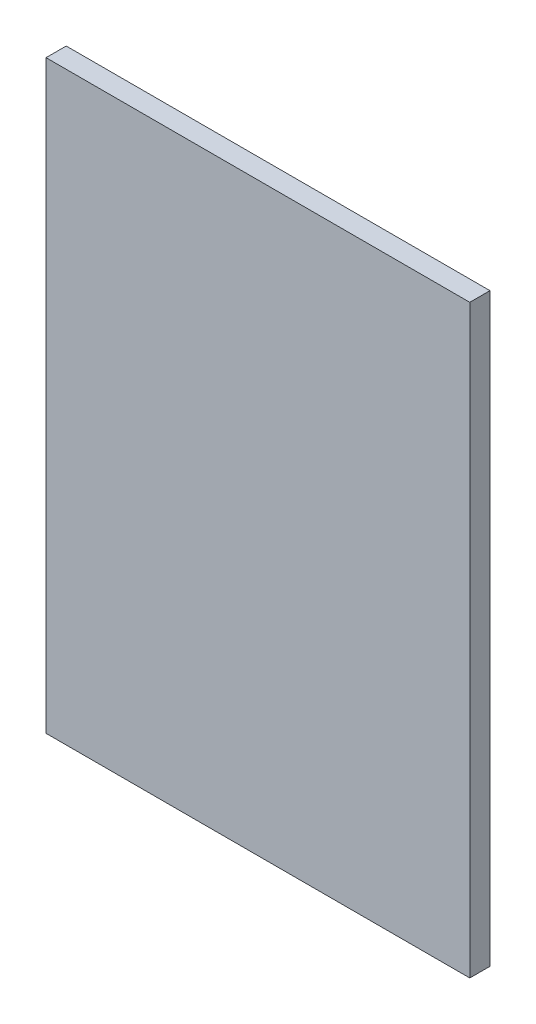
ISO-10303-21;
HEADER;
FILE_DESCRIPTION(('STEP AP214'),'2;1');
FILE_NAME('part.step','',(''),(''),'','','');
FILE_SCHEMA(('AUTOMOTIVE_DESIGN { 1 0 10303 214 1 1 1 1 }'));
ENDSEC;
DATA;
#1=APPLICATION_CONTEXT('core data for automotive mechanical design processes');
#2=APPLICATION_PROTOCOL_DEFINITION('international standard','automotive_design',2000,#1);
#3=PRODUCT_CONTEXT('',#1,'mechanical');
#4=PRODUCT('Part','Part','',(#3));
#5=PRODUCT_RELATED_PRODUCT_CATEGORY('part','',(#4));
#6=PRODUCT_DEFINITION_FORMATION('','',#4);
#7=PRODUCT_DEFINITION_CONTEXT('part definition',#1,'design');
#8=PRODUCT_DEFINITION('design','',#6,#7);
#9=PRODUCT_DEFINITION_SHAPE('','',#8);
#10=(LENGTH_UNIT() NAMED_UNIT(*) SI_UNIT(.MILLI.,.METRE.));
#11=(NAMED_UNIT(*) PLANE_ANGLE_UNIT() SI_UNIT($,.RADIAN.));
#12=(NAMED_UNIT(*) SI_UNIT($,.STERADIAN.) SOLID_ANGLE_UNIT());
#13=UNCERTAINTY_MEASURE_WITH_UNIT(LENGTH_MEASURE(1.E-05),#10,'distance_accuracy_value','');
#14=(GEOMETRIC_REPRESENTATION_CONTEXT(3) GLOBAL_UNCERTAINTY_ASSIGNED_CONTEXT((#13)) GLOBAL_UNIT_ASSIGNED_CONTEXT((#10,
#11,#12)) REPRESENTATION_CONTEXT('',''));
#15=CARTESIAN_POINT('',(0.,0.,0.));
#16=DIRECTION('',(0.,0.,1.));
#17=DIRECTION('',(1.,0.,0.));
#18=AXIS2_PLACEMENT_3D('',#15,#16,#17);
#19=CARTESIAN_POINT('',(-23.4490358126722,14.6776859504132,-2.));
#20=DIRECTION('',(-1.,0.,0.));
#21=DIRECTION('',(0.,0.,1.));
#22=AXIS2_PLACEMENT_3D('',#19,#20,#21);
#23=PLANE('',#22);
#24=DIRECTION('',(0.,-1.,0.));
#25=VECTOR('',#24,1.);
#26=CARTESIAN_POINT('',(-23.4490358126722,14.6776859504132,0.));
#27=LINE('',#26,#25);
#28=CARTESIAN_POINT('',(-23.4490358126722,14.6776859504132,0.));
#29=VERTEX_POINT('',#28);
#30=CARTESIAN_POINT('',(-23.4490358126722,-43.3223140495868,0.));
#31=VERTEX_POINT('',#30);
#32=EDGE_CURVE('E97',#29,#31,#27,.T.);
#33=ORIENTED_EDGE('',*,*,#32,.F.);
#34=DIRECTION('',(0.,0.,1.));
#35=VECTOR('',#34,1.);
#36=CARTESIAN_POINT('',(-23.4490358126722,14.6776859504132,-2.));
#37=LINE('',#36,#35);
#38=CARTESIAN_POINT('',(-23.4490358126722,14.6776859504132,-2.));
#39=VERTEX_POINT('',#38);
#40=EDGE_CURVE('E11',#39,#29,#37,.T.);
#41=ORIENTED_EDGE('',*,*,#40,.F.);
#42=DIRECTION('',(0.,-1.,0.));
#43=VECTOR('',#42,1.);
#44=CARTESIAN_POINT('',(-23.4490358126722,14.6776859504132,-2.));
#45=LINE('',#44,#43);
#46=CARTESIAN_POINT('',(-23.4490358126722,-43.3223140495868,-2.));
#47=VERTEX_POINT('',#46);
#48=EDGE_CURVE('E91',#39,#47,#45,.T.);
#49=ORIENTED_EDGE('',*,*,#48,.T.);
#50=DIRECTION('',(0.,0.,1.));
#51=VECTOR('',#50,1.);
#52=CARTESIAN_POINT('',(-23.4490358126722,-43.3223140495868,-2.));
#53=LINE('',#52,#51);
#54=EDGE_CURVE('E36',#47,#31,#53,.T.);
#55=ORIENTED_EDGE('',*,*,#54,.T.);
#56=EDGE_LOOP('',(#33,#41,#49,#55));
#57=FACE_BOUND('',#56,.T.);
#58=ADVANCED_FACE('F33',(#57),#23,.T.);
#59=CARTESIAN_POINT('',(-23.4490358126722,14.6776859504132,-2.));
#60=DIRECTION('',(0.,1.,0.));
#61=DIRECTION('',(0.,0.,1.));
#62=AXIS2_PLACEMENT_3D('',#59,#60,#61);
#63=PLANE('',#62);
#64=DIRECTION('',(-1.,0.,0.));
#65=VECTOR('',#64,1.);
#66=CARTESIAN_POINT('',(-23.4490358126722,14.6776859504132,0.));
#67=LINE('',#66,#65);
#68=CARTESIAN_POINT('',(18.5509641873278,14.6776859504132,0.));
#69=VERTEX_POINT('',#68);
#70=EDGE_CURVE('E93',#69,#29,#67,.T.);
#71=ORIENTED_EDGE('',*,*,#70,.F.);
#72=DIRECTION('',(0.,0.,1.));
#73=VECTOR('',#72,1.);
#74=CARTESIAN_POINT('',(18.5509641873278,14.6776859504132,-2.));
#75=LINE('',#74,#73);
#76=CARTESIAN_POINT('',(18.5509641873278,14.6776859504132,-2.));
#77=VERTEX_POINT('',#76);
#78=EDGE_CURVE('E42',#77,#69,#75,.T.);
#79=ORIENTED_EDGE('',*,*,#78,.F.);
#80=DIRECTION('',(-1.,0.,0.));
#81=VECTOR('',#80,1.);
#82=CARTESIAN_POINT('',(-23.4490358126722,14.6776859504132,-2.));
#83=LINE('',#82,#81);
#84=EDGE_CURVE('E88',#77,#39,#83,.T.);
#85=ORIENTED_EDGE('',*,*,#84,.T.);
#86=ORIENTED_EDGE('',*,*,#40,.T.);
#87=EDGE_LOOP('',(#71,#79,#85,#86));
#88=FACE_BOUND('',#87,.T.);
#89=ADVANCED_FACE('F107',(#88),#63,.T.);
#90=CARTESIAN_POINT('',(18.5509641873278,14.6776859504132,-2.));
#91=DIRECTION('',(1.,0.,0.));
#92=DIRECTION('',(0.,1.,0.));
#93=AXIS2_PLACEMENT_3D('',#90,#91,#92);
#94=PLANE('',#93);
#95=DIRECTION('',(0.,1.,0.));
#96=VECTOR('',#95,1.);
#97=CARTESIAN_POINT('',(18.5509641873278,14.6776859504132,0.));
#98=LINE('',#97,#96);
#99=CARTESIAN_POINT('',(18.5509641873278,-43.3223140495868,0.));
#100=VERTEX_POINT('',#99);
#101=EDGE_CURVE('E83',#100,#69,#98,.T.);
#102=ORIENTED_EDGE('',*,*,#101,.F.);
#103=DIRECTION('',(0.,0.,1.));
#104=VECTOR('',#103,1.);
#105=CARTESIAN_POINT('',(18.5509641873278,-43.3223140495868,-2.));
#106=LINE('',#105,#104);
#107=CARTESIAN_POINT('',(18.5509641873278,-43.3223140495868,-2.));
#108=VERTEX_POINT('',#107);
#109=EDGE_CURVE('E78',#108,#100,#106,.T.);
#110=ORIENTED_EDGE('',*,*,#109,.F.);
#111=DIRECTION('',(0.,1.,0.));
#112=VECTOR('',#111,1.);
#113=CARTESIAN_POINT('',(18.5509641873278,14.6776859504132,-2.));
#114=LINE('',#113,#112);
#115=EDGE_CURVE('E81',#108,#77,#114,.T.);
#116=ORIENTED_EDGE('',*,*,#115,.T.);
#117=ORIENTED_EDGE('',*,*,#78,.T.);
#118=EDGE_LOOP('',(#102,#110,#116,#117));
#119=FACE_BOUND('',#118,.T.);
#120=ADVANCED_FACE('F80',(#119),#94,.T.);
#121=CARTESIAN_POINT('',(-23.4490358126722,-43.3223140495868,-2.));
#122=DIRECTION('',(0.,-1.,0.));
#123=DIRECTION('',(0.,0.,-1.));
#124=AXIS2_PLACEMENT_3D('',#121,#122,#123);
#125=PLANE('',#124);
#126=DIRECTION('',(1.,0.,0.));
#127=VECTOR('',#126,1.);
#128=CARTESIAN_POINT('',(-23.4490358126722,-43.3223140495868,0.));
#129=LINE('',#128,#127);
#130=EDGE_CURVE('E100',#31,#100,#129,.T.);
#131=ORIENTED_EDGE('',*,*,#130,.F.);
#132=ORIENTED_EDGE('',*,*,#54,.F.);
#133=DIRECTION('',(1.,0.,0.));
#134=VECTOR('',#133,1.);
#135=CARTESIAN_POINT('',(-23.4490358126722,-43.3223140495868,-2.));
#136=LINE('',#135,#134);
#137=EDGE_CURVE('E87',#47,#108,#136,.T.);
#138=ORIENTED_EDGE('',*,*,#137,.T.);
#139=ORIENTED_EDGE('',*,*,#109,.T.);
#140=EDGE_LOOP('',(#131,#132,#138,#139));
#141=FACE_BOUND('',#140,.T.);
#142=ADVANCED_FACE('F90',(#141),#125,.T.);
#143=CARTESIAN_POINT('',(0.,0.,-2.));
#144=DIRECTION('',(0.,0.,1.));
#145=DIRECTION('',(1.,0.,0.));
#146=AXIS2_PLACEMENT_3D('',#143,#144,#145);
#147=PLANE('',#146);
#148=ORIENTED_EDGE('',*,*,#48,.F.);
#149=ORIENTED_EDGE('',*,*,#84,.F.);
#150=ORIENTED_EDGE('',*,*,#115,.F.);
#151=ORIENTED_EDGE('',*,*,#137,.F.);
#152=EDGE_LOOP('',(#148,#149,#150,#151));
#153=FACE_BOUND('',#152,.T.);
#154=ADVANCED_FACE('F86',(#153),#147,.F.);
#155=CARTESIAN_POINT('',(0.,0.,0.));
#156=DIRECTION('',(0.,0.,1.));
#157=DIRECTION('',(1.,0.,0.));
#158=AXIS2_PLACEMENT_3D('',#155,#156,#157);
#159=PLANE('',#158);
#160=ORIENTED_EDGE('',*,*,#32,.T.);
#161=ORIENTED_EDGE('',*,*,#130,.T.);
#162=ORIENTED_EDGE('',*,*,#101,.T.);
#163=ORIENTED_EDGE('',*,*,#70,.T.);
#164=EDGE_LOOP('',(#160,#161,#162,#163));
#165=FACE_BOUND('',#164,.T.);
#166=ADVANCED_FACE('F106',(#165),#159,.T.);
#167=CLOSED_SHELL('',(#58,#89,#120,#142,#154,#166));
#168=MANIFOLD_SOLID_BREP('B2',#167);
#169=ADVANCED_BREP_SHAPE_REPRESENTATION('',(#18,#168),#14);
#170=SHAPE_DEFINITION_REPRESENTATION(#9,#169);
ENDSEC;
END-ISO-10303-21;
